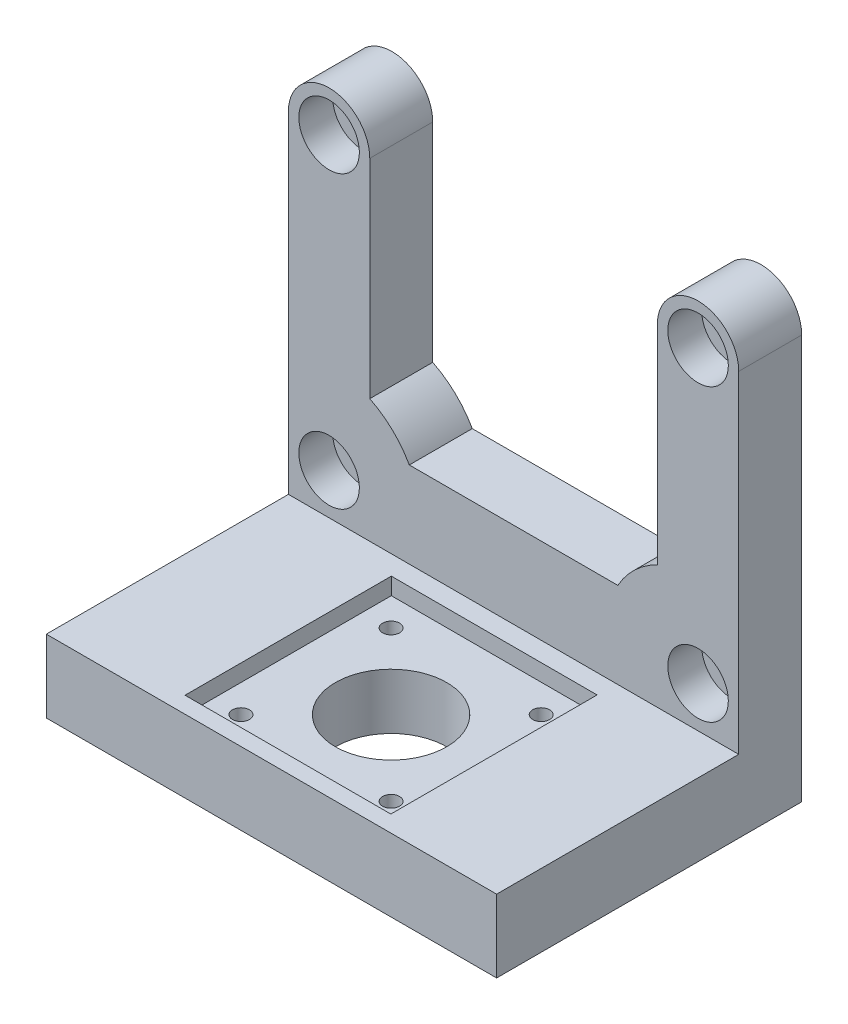
ISO-10303-21;
HEADER;
FILE_DESCRIPTION(('STEP AP214'),'2;1');
FILE_NAME('part.step','',(''),(''),'','','');
FILE_SCHEMA(('AUTOMOTIVE_DESIGN { 1 0 10303 214 1 1 1 1 }'));
ENDSEC;
DATA;
#1=APPLICATION_CONTEXT('core data for automotive mechanical design processes');
#2=APPLICATION_PROTOCOL_DEFINITION('international standard','automotive_design',2000,#1);
#3=PRODUCT_CONTEXT('',#1,'mechanical');
#4=PRODUCT('Part','Part','',(#3));
#5=PRODUCT_RELATED_PRODUCT_CATEGORY('part','',(#4));
#6=PRODUCT_DEFINITION_FORMATION('','',#4);
#7=PRODUCT_DEFINITION_CONTEXT('part definition',#1,'design');
#8=PRODUCT_DEFINITION('design','',#6,#7);
#9=PRODUCT_DEFINITION_SHAPE('','',#8);
#10=(LENGTH_UNIT() NAMED_UNIT(*) SI_UNIT(.MILLI.,.METRE.));
#11=(NAMED_UNIT(*) PLANE_ANGLE_UNIT() SI_UNIT($,.RADIAN.));
#12=(NAMED_UNIT(*) SI_UNIT($,.STERADIAN.) SOLID_ANGLE_UNIT());
#13=UNCERTAINTY_MEASURE_WITH_UNIT(LENGTH_MEASURE(1.E-05),#10,'distance_accuracy_value','');
#14=(GEOMETRIC_REPRESENTATION_CONTEXT(3) GLOBAL_UNCERTAINTY_ASSIGNED_CONTEXT((#13)) GLOBAL_UNIT_ASSIGNED_CONTEXT((#10,
#11,#12)) REPRESENTATION_CONTEXT('',''));
#15=CARTESIAN_POINT('',(0.,0.,0.));
#16=DIRECTION('',(0.,0.,1.));
#17=DIRECTION('',(1.,0.,0.));
#18=AXIS2_PLACEMENT_3D('',#15,#16,#17);
#19=CARTESIAN_POINT('',(-93.,86.9650108875533,0.));
#20=DIRECTION('',(0.,0.,1.));
#21=DIRECTION('',(1.,0.,0.));
#22=AXIS2_PLACEMENT_3D('',#19,#20,#21);
#23=PLANE('',#22);
#24=CARTESIAN_POINT('',(-8.4,8.5,0.));
#25=DIRECTION('',(0.,0.,1.));
#26=DIRECTION('',(1.,0.,0.));
#27=AXIS2_PLACEMENT_3D('',#24,#25,#26);
#28=CIRCLE('',#27,6.25);
#29=CARTESIAN_POINT('',(-2.15,8.5,0.));
#30=VERTEX_POINT('',#29);
#31=EDGE_CURVE('E392',#30,#30,#28,.F.);
#32=ORIENTED_EDGE('',*,*,#31,.T.);
#33=EDGE_LOOP('',(#32));
#34=FACE_BOUND('',#33,.T.);
#35=CARTESIAN_POINT('',(-84.6,8.5,0.));
#36=DIRECTION('',(0.,0.,1.));
#37=DIRECTION('',(1.,0.,0.));
#38=AXIS2_PLACEMENT_3D('',#35,#36,#37);
#39=CIRCLE('',#38,6.25);
#40=CARTESIAN_POINT('',(-78.35,8.5,0.));
#41=VERTEX_POINT('',#40);
#42=EDGE_CURVE('E258',#41,#41,#39,.F.);
#43=ORIENTED_EDGE('',*,*,#42,.T.);
#44=EDGE_LOOP('',(#43));
#45=FACE_BOUND('',#44,.T.);
#46=CARTESIAN_POINT('',(-8.4,68.5,0.));
#47=DIRECTION('',(0.,0.,1.));
#48=DIRECTION('',(1.,0.,0.));
#49=AXIS2_PLACEMENT_3D('',#46,#47,#48);
#50=CIRCLE('',#49,6.25000000000001);
#51=CARTESIAN_POINT('',(-2.14999999999999,68.5,0.));
#52=VERTEX_POINT('',#51);
#53=EDGE_CURVE('E390',#52,#52,#50,.F.);
#54=ORIENTED_EDGE('',*,*,#53,.T.);
#55=EDGE_LOOP('',(#54));
#56=FACE_BOUND('',#55,.T.);
#57=CARTESIAN_POINT('',(-84.6,68.5,0.));
#58=DIRECTION('',(0.,0.,1.));
#59=DIRECTION('',(1.,0.,0.));
#60=AXIS2_PLACEMENT_3D('',#57,#58,#59);
#61=CIRCLE('',#60,6.25);
#62=CARTESIAN_POINT('',(-78.35,68.5,0.));
#63=VERTEX_POINT('',#62);
#64=EDGE_CURVE('E59',#63,#63,#61,.F.);
#65=ORIENTED_EDGE('',*,*,#64,.T.);
#66=EDGE_LOOP('',(#65));
#67=FACE_BOUND('',#66,.T.);
#68=DIRECTION('',(0.,-1.,0.));
#69=VECTOR('',#68,1.);
#70=CARTESIAN_POINT('',(-76.2,0.,0.));
#71=LINE('',#70,#69);
#72=CARTESIAN_POINT('',(-76.2,68.5,0.));
#73=VERTEX_POINT('',#72);
#74=CARTESIAN_POINT('',(-76.2,25.5085891767193,0.));
#75=VERTEX_POINT('',#74);
#76=EDGE_CURVE('E195',#73,#75,#71,.T.);
#77=ORIENTED_EDGE('',*,*,#76,.F.);
#78=CARTESIAN_POINT('',(-84.6,68.5,0.));
#79=DIRECTION('',(0.,0.,1.));
#80=DIRECTION('',(1.,0.,0.));
#81=AXIS2_PLACEMENT_3D('',#78,#79,#80);
#82=CIRCLE('',#81,8.39999999999999);
#83=CARTESIAN_POINT('',(-93.,68.5,0.));
#84=VERTEX_POINT('',#83);
#85=EDGE_CURVE('E198',#73,#84,#82,.T.);
#86=ORIENTED_EDGE('',*,*,#85,.T.);
#87=DIRECTION('',(0.,-1.,0.));
#88=VECTOR('',#87,1.);
#89=CARTESIAN_POINT('',(-93.,86.9650108875533,0.));
#90=LINE('',#89,#88);
#91=CARTESIAN_POINT('',(-93.,0.,0.));
#92=VERTEX_POINT('',#91);
#93=EDGE_CURVE('E356',#84,#92,#90,.T.);
#94=ORIENTED_EDGE('',*,*,#93,.T.);
#95=DIRECTION('',(1.,0.,0.));
#96=VECTOR('',#95,1.);
#97=CARTESIAN_POINT('',(-93.,0.,0.));
#98=LINE('',#97,#96);
#99=CARTESIAN_POINT('',(0.,0.,0.));
#100=VERTEX_POINT('',#99);
#101=EDGE_CURVE('E370',#92,#100,#98,.T.);
#102=ORIENTED_EDGE('',*,*,#101,.T.);
#103=DIRECTION('',(0.,-1.,0.));
#104=VECTOR('',#103,1.);
#105=CARTESIAN_POINT('',(0.,86.9650108875533,0.));
#106=LINE('',#105,#104);
#107=CARTESIAN_POINT('',(0.,68.5,0.));
#108=VERTEX_POINT('',#107);
#109=EDGE_CURVE('E350',#108,#100,#106,.T.);
#110=ORIENTED_EDGE('',*,*,#109,.F.);
#111=CARTESIAN_POINT('',(-8.4,68.5,0.));
#112=DIRECTION('',(0.,0.,1.));
#113=DIRECTION('',(1.,0.,0.));
#114=AXIS2_PLACEMENT_3D('',#111,#112,#113);
#115=CIRCLE('',#114,8.39999999999999);
#116=CARTESIAN_POINT('',(-16.8,68.5,0.));
#117=VERTEX_POINT('',#116);
#118=EDGE_CURVE('E72',#108,#117,#115,.T.);
#119=ORIENTED_EDGE('',*,*,#118,.T.);
#120=DIRECTION('',(0.,-1.,0.));
#121=VECTOR('',#120,1.);
#122=CARTESIAN_POINT('',(-16.8,0.,0.));
#123=LINE('',#122,#121);
#124=CARTESIAN_POINT('',(-16.8,25.5085891767193,0.));
#125=VERTEX_POINT('',#124);
#126=EDGE_CURVE('E215',#117,#125,#123,.T.);
#127=ORIENTED_EDGE('',*,*,#126,.T.);
#128=CARTESIAN_POINT('',(-8.4,8.5,0.));
#129=DIRECTION('',(0.,0.,1.));
#130=DIRECTION('',(1.,0.,0.));
#131=AXIS2_PLACEMENT_3D('',#128,#129,#130);
#132=CIRCLE('',#131,18.9697682058166);
#133=CARTESIAN_POINT('',(-24.9665521480889,17.7412908030785,0.));
#134=VERTEX_POINT('',#133);
#135=EDGE_CURVE('E212',#125,#134,#132,.T.);
#136=ORIENTED_EDGE('',*,*,#135,.T.);
#137=DIRECTION('',(1.,0.,0.));
#138=VECTOR('',#137,1.);
#139=CARTESIAN_POINT('',(0.,17.7412908030785,0.));
#140=LINE('',#139,#138);
#141=CARTESIAN_POINT('',(-68.0334478519111,17.7412908030785,0.));
#142=VERTEX_POINT('',#141);
#143=EDGE_CURVE('E210',#142,#134,#140,.T.);
#144=ORIENTED_EDGE('',*,*,#143,.F.);
#145=CARTESIAN_POINT('',(-84.6,8.5,0.));
#146=DIRECTION('',(0.,0.,1.));
#147=DIRECTION('',(1.,0.,0.));
#148=AXIS2_PLACEMENT_3D('',#145,#146,#147);
#149=CIRCLE('',#148,18.9697682058166);
#150=EDGE_CURVE('E175',#142,#75,#149,.T.);
#151=ORIENTED_EDGE('',*,*,#150,.T.);
#152=EDGE_LOOP('',(#77,#86,#94,#102,#110,#119,#127,#136,#144,#151));
#153=FACE_BOUND('',#152,.T.);
#154=ADVANCED_FACE('F56',(#34,#45,#56,#67,#153),#23,.T.);
#155=CARTESIAN_POINT('',(-93.,-15.,-13.));
#156=DIRECTION('',(0.,0.,-1.));
#157=DIRECTION('',(0.,1.,0.));
#158=AXIS2_PLACEMENT_3D('',#155,#156,#157);
#159=PLANE('',#158);
#160=CARTESIAN_POINT('',(-84.6,8.5,-13.));
#161=DIRECTION('',(0.,0.,1.));
#162=DIRECTION('',(1.,0.,0.));
#163=AXIS2_PLACEMENT_3D('',#160,#161,#162);
#164=CIRCLE('',#163,3.25000000000001);
#165=CARTESIAN_POINT('',(-81.35,8.5,-13.));
#166=VERTEX_POINT('',#165);
#167=EDGE_CURVE('E266',#166,#166,#164,.T.);
#168=ORIENTED_EDGE('',*,*,#167,.T.);
#169=EDGE_LOOP('',(#168));
#170=FACE_BOUND('',#169,.T.);
#171=CARTESIAN_POINT('',(-8.4,8.5,-13.));
#172=DIRECTION('',(0.,0.,1.));
#173=DIRECTION('',(1.,0.,0.));
#174=AXIS2_PLACEMENT_3D('',#171,#172,#173);
#175=CIRCLE('',#174,3.25);
#176=CARTESIAN_POINT('',(-5.15,8.5,-13.));
#177=VERTEX_POINT('',#176);
#178=EDGE_CURVE('E263',#177,#177,#175,.T.);
#179=ORIENTED_EDGE('',*,*,#178,.T.);
#180=EDGE_LOOP('',(#179));
#181=FACE_BOUND('',#180,.T.);
#182=CARTESIAN_POINT('',(-8.4,68.5,-13.));
#183=DIRECTION('',(0.,0.,1.));
#184=DIRECTION('',(1.,0.,0.));
#185=AXIS2_PLACEMENT_3D('',#182,#183,#184);
#186=CIRCLE('',#185,3.25);
#187=CARTESIAN_POINT('',(-5.15,68.5,-13.));
#188=VERTEX_POINT('',#187);
#189=EDGE_CURVE('E259',#188,#188,#186,.T.);
#190=ORIENTED_EDGE('',*,*,#189,.T.);
#191=EDGE_LOOP('',(#190));
#192=FACE_BOUND('',#191,.T.);
#193=CARTESIAN_POINT('',(-84.6,68.5,-13.));
#194=DIRECTION('',(0.,0.,1.));
#195=DIRECTION('',(1.,0.,0.));
#196=AXIS2_PLACEMENT_3D('',#193,#194,#195);
#197=CIRCLE('',#196,3.25000000000001);
#198=CARTESIAN_POINT('',(-81.35,68.5,-13.));
#199=VERTEX_POINT('',#198);
#200=EDGE_CURVE('E262',#199,#199,#197,.T.);
#201=ORIENTED_EDGE('',*,*,#200,.T.);
#202=EDGE_LOOP('',(#201));
#203=FACE_BOUND('',#202,.T.);
#204=DIRECTION('',(0.,1.,0.));
#205=VECTOR('',#204,1.);
#206=CARTESIAN_POINT('',(-93.,-15.,-13.));
#207=LINE('',#206,#205);
#208=CARTESIAN_POINT('',(-93.,-15.,-13.));
#209=VERTEX_POINT('',#208);
#210=CARTESIAN_POINT('',(-93.,68.5,-13.));
#211=VERTEX_POINT('',#210);
#212=EDGE_CURVE('E368',#209,#211,#207,.T.);
#213=ORIENTED_EDGE('',*,*,#212,.T.);
#214=CARTESIAN_POINT('',(-84.6,68.5,-13.));
#215=DIRECTION('',(0.,0.,1.));
#216=DIRECTION('',(1.,0.,0.));
#217=AXIS2_PLACEMENT_3D('',#214,#215,#216);
#218=CIRCLE('',#217,8.39999999999999);
#219=CARTESIAN_POINT('',(-76.2,68.5,-13.));
#220=VERTEX_POINT('',#219);
#221=EDGE_CURVE('E206',#220,#211,#218,.T.);
#222=ORIENTED_EDGE('',*,*,#221,.F.);
#223=DIRECTION('',(0.,-1.,0.));
#224=VECTOR('',#223,1.);
#225=CARTESIAN_POINT('',(-76.2,0.,-13.));
#226=LINE('',#225,#224);
#227=CARTESIAN_POINT('',(-76.2,25.5085891767193,-13.));
#228=VERTEX_POINT('',#227);
#229=EDGE_CURVE('E180',#220,#228,#226,.T.);
#230=ORIENTED_EDGE('',*,*,#229,.T.);
#231=CARTESIAN_POINT('',(-84.6,8.5,-13.));
#232=DIRECTION('',(0.,0.,1.));
#233=DIRECTION('',(1.,0.,0.));
#234=AXIS2_PLACEMENT_3D('',#231,#232,#233);
#235=CIRCLE('',#234,18.9697682058166);
#236=CARTESIAN_POINT('',(-68.0334478519111,17.7412908030785,-13.));
#237=VERTEX_POINT('',#236);
#238=EDGE_CURVE('E172',#237,#228,#235,.T.);
#239=ORIENTED_EDGE('',*,*,#238,.F.);
#240=DIRECTION('',(1.,0.,0.));
#241=VECTOR('',#240,1.);
#242=CARTESIAN_POINT('',(0.,17.7412908030785,-13.));
#243=LINE('',#242,#241);
#244=CARTESIAN_POINT('',(-24.9665521480889,17.7412908030785,-13.));
#245=VERTEX_POINT('',#244);
#246=EDGE_CURVE('E184',#237,#245,#243,.T.);
#247=ORIENTED_EDGE('',*,*,#246,.T.);
#248=CARTESIAN_POINT('',(-8.4,8.5,-13.));
#249=DIRECTION('',(0.,0.,1.));
#250=DIRECTION('',(1.,0.,0.));
#251=AXIS2_PLACEMENT_3D('',#248,#249,#250);
#252=CIRCLE('',#251,18.9697682058166);
#253=CARTESIAN_POINT('',(-16.8,25.5085891767193,-13.));
#254=VERTEX_POINT('',#253);
#255=EDGE_CURVE('E188',#254,#245,#252,.T.);
#256=ORIENTED_EDGE('',*,*,#255,.F.);
#257=DIRECTION('',(0.,-1.,0.));
#258=VECTOR('',#257,1.);
#259=CARTESIAN_POINT('',(-16.8,0.,-13.));
#260=LINE('',#259,#258);
#261=CARTESIAN_POINT('',(-16.8,68.5,-13.));
#262=VERTEX_POINT('',#261);
#263=EDGE_CURVE('E202',#262,#254,#260,.T.);
#264=ORIENTED_EDGE('',*,*,#263,.F.);
#265=CARTESIAN_POINT('',(-8.4,68.5,-13.));
#266=DIRECTION('',(0.,0.,1.));
#267=DIRECTION('',(1.,0.,0.));
#268=AXIS2_PLACEMENT_3D('',#265,#266,#267);
#269=CIRCLE('',#268,8.39999999999999);
#270=CARTESIAN_POINT('',(0.,68.5,-13.));
#271=VERTEX_POINT('',#270);
#272=EDGE_CURVE('E204',#271,#262,#269,.T.);
#273=ORIENTED_EDGE('',*,*,#272,.F.);
#274=DIRECTION('',(0.,1.,0.));
#275=VECTOR('',#274,1.);
#276=CARTESIAN_POINT('',(0.,-15.,-13.));
#277=LINE('',#276,#275);
#278=CARTESIAN_POINT('',(0.,-15.,-13.));
#279=VERTEX_POINT('',#278);
#280=EDGE_CURVE('E359',#279,#271,#277,.T.);
#281=ORIENTED_EDGE('',*,*,#280,.F.);
#282=DIRECTION('',(1.,0.,0.));
#283=VECTOR('',#282,1.);
#284=CARTESIAN_POINT('',(-93.,-15.,-13.));
#285=LINE('',#284,#283);
#286=EDGE_CURVE('E12',#209,#279,#285,.T.);
#287=ORIENTED_EDGE('',*,*,#286,.F.);
#288=EDGE_LOOP('',(#213,#222,#230,#239,#247,#256,#264,#273,#281,#287));
#289=FACE_BOUND('',#288,.T.);
#290=ADVANCED_FACE('F192',(#170,#181,#192,#203,#289),#159,.T.);
#291=CARTESIAN_POINT('',(-84.6,68.5,-13.));
#292=DIRECTION('',(0.,0.,1.));
#293=DIRECTION('',(1.,0.,0.));
#294=AXIS2_PLACEMENT_3D('',#291,#292,#293);
#295=CYLINDRICAL_SURFACE('',#294,3.25000000000001);
#296=ORIENTED_EDGE('',*,*,#200,.F.);
#297=EDGE_LOOP('',(#296));
#298=FACE_BOUND('',#297,.T.);
#299=CARTESIAN_POINT('',(-84.6,68.5,-7.));
#300=DIRECTION('',(0.,0.,1.));
#301=DIRECTION('',(1.,0.,0.));
#302=AXIS2_PLACEMENT_3D('',#299,#300,#301);
#303=CIRCLE('',#302,3.25000000000001);
#304=CARTESIAN_POINT('',(-81.35,68.5,-7.));
#305=VERTEX_POINT('',#304);
#306=EDGE_CURVE('E223',#305,#305,#303,.T.);
#307=ORIENTED_EDGE('',*,*,#306,.T.);
#308=EDGE_LOOP('',(#307));
#309=FACE_BOUND('',#308,.T.);
#310=ADVANCED_FACE('F423',(#298,#309),#295,.F.);
#311=CARTESIAN_POINT('',(-8.4,68.5,-13.));
#312=DIRECTION('',(0.,0.,1.));
#313=DIRECTION('',(1.,0.,0.));
#314=AXIS2_PLACEMENT_3D('',#311,#312,#313);
#315=CYLINDRICAL_SURFACE('',#314,3.25);
#316=ORIENTED_EDGE('',*,*,#189,.F.);
#317=EDGE_LOOP('',(#316));
#318=FACE_BOUND('',#317,.T.);
#319=CARTESIAN_POINT('',(-8.4,68.5,-7.));
#320=DIRECTION('',(0.,0.,1.));
#321=DIRECTION('',(1.,0.,0.));
#322=AXIS2_PLACEMENT_3D('',#319,#320,#321);
#323=CIRCLE('',#322,3.25);
#324=CARTESIAN_POINT('',(-5.15,68.5,-7.));
#325=VERTEX_POINT('',#324);
#326=EDGE_CURVE('E235',#325,#325,#323,.T.);
#327=ORIENTED_EDGE('',*,*,#326,.T.);
#328=EDGE_LOOP('',(#327));
#329=FACE_BOUND('',#328,.T.);
#330=ADVANCED_FACE('F470',(#318,#329),#315,.F.);
#331=CARTESIAN_POINT('',(-8.4,8.5,-13.));
#332=DIRECTION('',(0.,0.,1.));
#333=DIRECTION('',(1.,0.,0.));
#334=AXIS2_PLACEMENT_3D('',#331,#332,#333);
#335=CYLINDRICAL_SURFACE('',#334,3.25);
#336=ORIENTED_EDGE('',*,*,#178,.F.);
#337=EDGE_LOOP('',(#336));
#338=FACE_BOUND('',#337,.T.);
#339=CARTESIAN_POINT('',(-8.4,8.5,-7.));
#340=DIRECTION('',(0.,0.,1.));
#341=DIRECTION('',(1.,0.,0.));
#342=AXIS2_PLACEMENT_3D('',#339,#340,#341);
#343=CIRCLE('',#342,3.25);
#344=CARTESIAN_POINT('',(-5.15,8.5,-7.));
#345=VERTEX_POINT('',#344);
#346=EDGE_CURVE('E243',#345,#345,#343,.T.);
#347=ORIENTED_EDGE('',*,*,#346,.T.);
#348=EDGE_LOOP('',(#347));
#349=FACE_BOUND('',#348,.T.);
#350=ADVANCED_FACE('F473',(#338,#349),#335,.F.);
#351=CARTESIAN_POINT('',(-84.6,8.5,-13.));
#352=DIRECTION('',(0.,0.,1.));
#353=DIRECTION('',(1.,0.,0.));
#354=AXIS2_PLACEMENT_3D('',#351,#352,#353);
#355=CYLINDRICAL_SURFACE('',#354,3.25000000000001);
#356=ORIENTED_EDGE('',*,*,#167,.F.);
#357=EDGE_LOOP('',(#356));
#358=FACE_BOUND('',#357,.T.);
#359=CARTESIAN_POINT('',(-84.6,8.5,-7.));
#360=DIRECTION('',(0.,0.,1.));
#361=DIRECTION('',(1.,0.,0.));
#362=AXIS2_PLACEMENT_3D('',#359,#360,#361);
#363=CIRCLE('',#362,3.25000000000001);
#364=CARTESIAN_POINT('',(-81.35,8.5,-7.));
#365=VERTEX_POINT('',#364);
#366=EDGE_CURVE('E242',#365,#365,#363,.T.);
#367=ORIENTED_EDGE('',*,*,#366,.T.);
#368=EDGE_LOOP('',(#367));
#369=FACE_BOUND('',#368,.T.);
#370=ADVANCED_FACE('F477',(#358,#369),#355,.F.);
#371=CARTESIAN_POINT('',(-62.,-15.,9.8));
#372=DIRECTION('',(0.,1.,0.));
#373=DIRECTION('',(0.,0.,1.));
#374=AXIS2_PLACEMENT_3D('',#371,#372,#373);
#375=CYLINDRICAL_SURFACE('',#374,1.75);
#376=CARTESIAN_POINT('',(-62.,-3.5,9.8));
#377=DIRECTION('',(0.,1.,0.));
#378=DIRECTION('',(0.,0.,1.));
#379=AXIS2_PLACEMENT_3D('',#376,#377,#378);
#380=CIRCLE('',#379,1.75);
#381=CARTESIAN_POINT('',(-62.,-3.5,11.55));
#382=VERTEX_POINT('',#381);
#383=EDGE_CURVE('E311',#382,#382,#380,.T.);
#384=ORIENTED_EDGE('',*,*,#383,.T.);
#385=EDGE_LOOP('',(#384));
#386=FACE_BOUND('',#385,.T.);
#387=CARTESIAN_POINT('',(-62.,-12.,9.8));
#388=DIRECTION('',(0.,-1.,0.));
#389=DIRECTION('',(0.,0.,-1.));
#390=AXIS2_PLACEMENT_3D('',#387,#388,#389);
#391=CIRCLE('',#390,1.75);
#392=CARTESIAN_POINT('',(-62.,-12.,8.05));
#393=VERTEX_POINT('',#392);
#394=EDGE_CURVE('E280',#393,#393,#391,.T.);
#395=ORIENTED_EDGE('',*,*,#394,.T.);
#396=EDGE_LOOP('',(#395));
#397=FACE_BOUND('',#396,.T.);
#398=ADVANCED_FACE('F481',(#386,#397),#375,.F.);
#399=CARTESIAN_POINT('',(-31.,-15.,9.8));
#400=DIRECTION('',(0.,1.,0.));
#401=DIRECTION('',(0.,0.,1.));
#402=AXIS2_PLACEMENT_3D('',#399,#400,#401);
#403=CYLINDRICAL_SURFACE('',#402,1.75);
#404=CARTESIAN_POINT('',(-31.,-3.5,9.8));
#405=DIRECTION('',(0.,1.,0.));
#406=DIRECTION('',(0.,0.,1.));
#407=AXIS2_PLACEMENT_3D('',#404,#405,#406);
#408=CIRCLE('',#407,1.75);
#409=CARTESIAN_POINT('',(-31.,-3.5,11.55));
#410=VERTEX_POINT('',#409);
#411=EDGE_CURVE('E308',#410,#410,#408,.T.);
#412=ORIENTED_EDGE('',*,*,#411,.T.);
#413=EDGE_LOOP('',(#412));
#414=FACE_BOUND('',#413,.T.);
#415=CARTESIAN_POINT('',(-31.,-12.,9.8));
#416=DIRECTION('',(0.,-1.,0.));
#417=DIRECTION('',(0.,0.,-1.));
#418=AXIS2_PLACEMENT_3D('',#415,#416,#417);
#419=CIRCLE('',#418,1.75);
#420=CARTESIAN_POINT('',(-31.,-12.,8.05));
#421=VERTEX_POINT('',#420);
#422=EDGE_CURVE('E272',#421,#421,#419,.T.);
#423=ORIENTED_EDGE('',*,*,#422,.T.);
#424=EDGE_LOOP('',(#423));
#425=FACE_BOUND('',#424,.T.);
#426=ADVANCED_FACE('F518',(#414,#425),#403,.F.);
#427=CARTESIAN_POINT('',(-31.,-15.,40.8));
#428=DIRECTION('',(0.,1.,0.));
#429=DIRECTION('',(0.,0.,1.));
#430=AXIS2_PLACEMENT_3D('',#427,#428,#429);
#431=CYLINDRICAL_SURFACE('',#430,1.75);
#432=CARTESIAN_POINT('',(-31.,-3.5,40.8));
#433=DIRECTION('',(0.,1.,0.));
#434=DIRECTION('',(0.,0.,1.));
#435=AXIS2_PLACEMENT_3D('',#432,#433,#434);
#436=CIRCLE('',#435,1.75);
#437=CARTESIAN_POINT('',(-31.,-3.5,42.55));
#438=VERTEX_POINT('',#437);
#439=EDGE_CURVE('E312',#438,#438,#436,.T.);
#440=ORIENTED_EDGE('',*,*,#439,.T.);
#441=EDGE_LOOP('',(#440));
#442=FACE_BOUND('',#441,.T.);
#443=CARTESIAN_POINT('',(-31.,-12.,40.8));
#444=DIRECTION('',(0.,-1.,0.));
#445=DIRECTION('',(0.,0.,-1.));
#446=AXIS2_PLACEMENT_3D('',#443,#444,#445);
#447=CIRCLE('',#446,1.75);
#448=CARTESIAN_POINT('',(-31.,-12.,39.05));
#449=VERTEX_POINT('',#448);
#450=EDGE_CURVE('E283',#449,#449,#447,.T.);
#451=ORIENTED_EDGE('',*,*,#450,.T.);
#452=EDGE_LOOP('',(#451));
#453=FACE_BOUND('',#452,.T.);
#454=ADVANCED_FACE('F521',(#442,#453),#431,.F.);
#455=CARTESIAN_POINT('',(-62.,-15.,40.8));
#456=DIRECTION('',(0.,1.,0.));
#457=DIRECTION('',(0.,0.,1.));
#458=AXIS2_PLACEMENT_3D('',#455,#456,#457);
#459=CYLINDRICAL_SURFACE('',#458,1.75);
#460=CARTESIAN_POINT('',(-62.,-3.5,40.8));
#461=DIRECTION('',(0.,1.,0.));
#462=DIRECTION('',(0.,0.,1.));
#463=AXIS2_PLACEMENT_3D('',#460,#461,#462);
#464=CIRCLE('',#463,1.75);
#465=CARTESIAN_POINT('',(-62.,-3.5,42.55));
#466=VERTEX_POINT('',#465);
#467=EDGE_CURVE('E305',#466,#466,#464,.T.);
#468=ORIENTED_EDGE('',*,*,#467,.T.);
#469=EDGE_LOOP('',(#468));
#470=FACE_BOUND('',#469,.T.);
#471=CARTESIAN_POINT('',(-62.,-12.,40.8));
#472=DIRECTION('',(0.,-1.,0.));
#473=DIRECTION('',(0.,0.,-1.));
#474=AXIS2_PLACEMENT_3D('',#471,#472,#473);
#475=CIRCLE('',#474,1.75);
#476=CARTESIAN_POINT('',(-62.,-12.,39.05));
#477=VERTEX_POINT('',#476);
#478=EDGE_CURVE('E271',#477,#477,#475,.T.);
#479=ORIENTED_EDGE('',*,*,#478,.T.);
#480=EDGE_LOOP('',(#479));
#481=FACE_BOUND('',#480,.T.);
#482=ADVANCED_FACE('F525',(#470,#481),#459,.F.);
#483=CARTESIAN_POINT('',(-93.,-15.,50.));
#484=DIRECTION('',(0.,-1.,0.));
#485=DIRECTION('',(0.,0.,-1.));
#486=AXIS2_PLACEMENT_3D('',#483,#484,#485);
#487=PLANE('',#486);
#488=CARTESIAN_POINT('',(-62.,-15.,40.8));
#489=DIRECTION('',(0.,-1.,0.));
#490=DIRECTION('',(0.,0.,-1.));
#491=AXIS2_PLACEMENT_3D('',#488,#489,#490);
#492=CIRCLE('',#491,3.);
#493=CARTESIAN_POINT('',(-62.,-15.,37.8));
#494=VERTEX_POINT('',#493);
#495=EDGE_CURVE('E294',#494,#494,#492,.T.);
#496=ORIENTED_EDGE('',*,*,#495,.F.);
#497=EDGE_LOOP('',(#496));
#498=FACE_BOUND('',#497,.T.);
#499=CARTESIAN_POINT('',(-31.,-15.,40.8));
#500=DIRECTION('',(0.,-1.,0.));
#501=DIRECTION('',(0.,0.,-1.));
#502=AXIS2_PLACEMENT_3D('',#499,#500,#501);
#503=CIRCLE('',#502,3.);
#504=CARTESIAN_POINT('',(-31.,-15.,37.8));
#505=VERTEX_POINT('',#504);
#506=EDGE_CURVE('E286',#505,#505,#503,.T.);
#507=ORIENTED_EDGE('',*,*,#506,.F.);
#508=EDGE_LOOP('',(#507));
#509=FACE_BOUND('',#508,.T.);
#510=CARTESIAN_POINT('',(-31.,-15.,9.8));
#511=DIRECTION('',(0.,-1.,0.));
#512=DIRECTION('',(0.,0.,-1.));
#513=AXIS2_PLACEMENT_3D('',#510,#511,#512);
#514=CIRCLE('',#513,3.);
#515=CARTESIAN_POINT('',(-31.,-15.,6.8));
#516=VERTEX_POINT('',#515);
#517=EDGE_CURVE('E275',#516,#516,#514,.T.);
#518=ORIENTED_EDGE('',*,*,#517,.F.);
#519=EDGE_LOOP('',(#518));
#520=FACE_BOUND('',#519,.T.);
#521=CARTESIAN_POINT('',(-62.,-15.,9.8));
#522=DIRECTION('',(0.,-1.,0.));
#523=DIRECTION('',(0.,0.,-1.));
#524=AXIS2_PLACEMENT_3D('',#521,#522,#523);
#525=CIRCLE('',#524,3.);
#526=CARTESIAN_POINT('',(-62.,-15.,6.8));
#527=VERTEX_POINT('',#526);
#528=EDGE_CURVE('E301',#527,#527,#525,.T.);
#529=ORIENTED_EDGE('',*,*,#528,.F.);
#530=EDGE_LOOP('',(#529));
#531=FACE_BOUND('',#530,.T.);
#532=CARTESIAN_POINT('',(-46.5,-15.,25.3));
#533=DIRECTION('',(0.,1.,0.));
#534=DIRECTION('',(0.,0.,1.));
#535=AXIS2_PLACEMENT_3D('',#532,#533,#534);
#536=CIRCLE('',#535,11.5);
#537=CARTESIAN_POINT('',(-46.5,-15.,36.8));
#538=VERTEX_POINT('',#537);
#539=EDGE_CURVE('E320',#538,#538,#536,.T.);
#540=ORIENTED_EDGE('',*,*,#539,.T.);
#541=EDGE_LOOP('',(#540));
#542=FACE_BOUND('',#541,.T.);
#543=DIRECTION('',(0.,0.,-1.));
#544=VECTOR('',#543,1.);
#545=CARTESIAN_POINT('',(0.,-15.,50.));
#546=LINE('',#545,#544);
#547=CARTESIAN_POINT('',(0.,-15.,50.));
#548=VERTEX_POINT('',#547);
#549=EDGE_CURVE('E378',#548,#279,#546,.T.);
#550=ORIENTED_EDGE('',*,*,#549,.F.);
#551=DIRECTION('',(1.,0.,0.));
#552=VECTOR('',#551,1.);
#553=CARTESIAN_POINT('',(-93.,-15.,50.));
#554=LINE('',#553,#552);
#555=CARTESIAN_POINT('',(-93.,-15.,50.));
#556=VERTEX_POINT('',#555);
#557=EDGE_CURVE('E64',#556,#548,#554,.T.);
#558=ORIENTED_EDGE('',*,*,#557,.F.);
#559=DIRECTION('',(0.,0.,-1.));
#560=VECTOR('',#559,1.);
#561=CARTESIAN_POINT('',(-93.,-15.,50.));
#562=LINE('',#561,#560);
#563=EDGE_CURVE('E365',#556,#209,#562,.T.);
#564=ORIENTED_EDGE('',*,*,#563,.T.);
#565=ORIENTED_EDGE('',*,*,#286,.T.);
#566=EDGE_LOOP('',(#550,#558,#564,#565));
#567=FACE_BOUND('',#566,.T.);
#568=ADVANCED_FACE('F529',(#498,#509,#520,#531,#542,#567),#487,.T.);
#569=CARTESIAN_POINT('',(-93.,0.,50.));
#570=DIRECTION('',(0.,0.,1.));
#571=DIRECTION('',(1.,0.,0.));
#572=AXIS2_PLACEMENT_3D('',#569,#570,#571);
#573=PLANE('',#572);
#574=DIRECTION('',(0.,-1.,0.));
#575=VECTOR('',#574,1.);
#576=CARTESIAN_POINT('',(0.,0.,50.));
#577=LINE('',#576,#575);
#578=CARTESIAN_POINT('',(0.,0.,50.));
#579=VERTEX_POINT('',#578);
#580=EDGE_CURVE('E375',#579,#548,#577,.T.);
#581=ORIENTED_EDGE('',*,*,#580,.F.);
#582=DIRECTION('',(1.,0.,0.));
#583=VECTOR('',#582,1.);
#584=CARTESIAN_POINT('',(-93.,0.,50.));
#585=LINE('',#584,#583);
#586=CARTESIAN_POINT('',(-93.,0.,50.));
#587=VERTEX_POINT('',#586);
#588=EDGE_CURVE('E384',#587,#579,#585,.T.);
#589=ORIENTED_EDGE('',*,*,#588,.F.);
#590=DIRECTION('',(0.,-1.,0.));
#591=VECTOR('',#590,1.);
#592=CARTESIAN_POINT('',(-93.,0.,50.));
#593=LINE('',#592,#591);
#594=EDGE_CURVE('E362',#587,#556,#593,.T.);
#595=ORIENTED_EDGE('',*,*,#594,.T.);
#596=ORIENTED_EDGE('',*,*,#557,.T.);
#597=EDGE_LOOP('',(#581,#589,#595,#596));
#598=FACE_BOUND('',#597,.T.);
#599=ADVANCED_FACE('F567',(#598),#573,.T.);
#600=CARTESIAN_POINT('',(-93.,0.,0.));
#601=DIRECTION('',(0.,1.,0.));
#602=DIRECTION('',(0.,0.,1.));
#603=AXIS2_PLACEMENT_3D('',#600,#601,#602);
#604=PLANE('',#603);
#605=DIRECTION('',(0.,0.,-1.));
#606=VECTOR('',#605,1.);
#607=CARTESIAN_POINT('',(-25.25,0.,46.6));
#608=LINE('',#607,#606);
#609=CARTESIAN_POINT('',(-25.25,0.,46.6));
#610=VERTEX_POINT('',#609);
#611=CARTESIAN_POINT('',(-25.25,0.,4.));
#612=VERTEX_POINT('',#611);
#613=EDGE_CURVE('E80',#610,#612,#608,.T.);
#614=ORIENTED_EDGE('',*,*,#613,.F.);
#615=DIRECTION('',(1.,0.,0.));
#616=VECTOR('',#615,1.);
#617=CARTESIAN_POINT('',(-67.75,0.,46.6));
#618=LINE('',#617,#616);
#619=CARTESIAN_POINT('',(-67.75,0.,46.6));
#620=VERTEX_POINT('',#619);
#621=EDGE_CURVE('E329',#620,#610,#618,.T.);
#622=ORIENTED_EDGE('',*,*,#621,.F.);
#623=DIRECTION('',(0.,0.,1.));
#624=VECTOR('',#623,1.);
#625=CARTESIAN_POINT('',(-67.75,0.,46.6));
#626=LINE('',#625,#624);
#627=CARTESIAN_POINT('',(-67.75,0.,4.));
#628=VERTEX_POINT('',#627);
#629=EDGE_CURVE('E343',#628,#620,#626,.T.);
#630=ORIENTED_EDGE('',*,*,#629,.F.);
#631=DIRECTION('',(-1.,0.,0.));
#632=VECTOR('',#631,1.);
#633=CARTESIAN_POINT('',(-67.75,0.,4.));
#634=LINE('',#633,#632);
#635=EDGE_CURVE('E340',#612,#628,#634,.T.);
#636=ORIENTED_EDGE('',*,*,#635,.F.);
#637=EDGE_LOOP('',(#614,#622,#630,#636));
#638=FACE_BOUND('',#637,.T.);
#639=DIRECTION('',(0.,0.,1.));
#640=VECTOR('',#639,1.);
#641=CARTESIAN_POINT('',(0.,0.,0.));
#642=LINE('',#641,#640);
#643=EDGE_CURVE('E372',#100,#579,#642,.T.);
#644=ORIENTED_EDGE('',*,*,#643,.F.);
#645=ORIENTED_EDGE('',*,*,#101,.F.);
#646=DIRECTION('',(0.,0.,1.));
#647=VECTOR('',#646,1.);
#648=CARTESIAN_POINT('',(-93.,0.,0.));
#649=LINE('',#648,#647);
#650=EDGE_CURVE('E358',#92,#587,#649,.T.);
#651=ORIENTED_EDGE('',*,*,#650,.T.);
#652=ORIENTED_EDGE('',*,*,#588,.T.);
#653=EDGE_LOOP('',(#644,#645,#651,#652));
#654=FACE_BOUND('',#653,.T.);
#655=ADVANCED_FACE('F560',(#638,#654),#604,.T.);
#656=CARTESIAN_POINT('',(-93.,0.,0.));
#657=DIRECTION('',(-1.,0.,0.));
#658=DIRECTION('',(0.,0.,1.));
#659=AXIS2_PLACEMENT_3D('',#656,#657,#658);
#660=PLANE('',#659);
#661=DIRECTION('',(0.,0.,1.));
#662=VECTOR('',#661,1.);
#663=CARTESIAN_POINT('',(-93.,68.5,-13.));
#664=LINE('',#663,#662);
#665=EDGE_CURVE('E226',#211,#84,#664,.T.);
#666=ORIENTED_EDGE('',*,*,#665,.F.);
#667=ORIENTED_EDGE('',*,*,#212,.F.);
#668=ORIENTED_EDGE('',*,*,#563,.F.);
#669=ORIENTED_EDGE('',*,*,#594,.F.);
#670=ORIENTED_EDGE('',*,*,#650,.F.);
#671=ORIENTED_EDGE('',*,*,#93,.F.);
#672=EDGE_LOOP('',(#666,#667,#668,#669,#670,#671));
#673=FACE_BOUND('',#672,.T.);
#674=ADVANCED_FACE('F557',(#673),#660,.T.);
#675=CARTESIAN_POINT('',(0.,0.,0.));
#676=DIRECTION('',(-1.,0.,0.));
#677=DIRECTION('',(0.,0.,1.));
#678=AXIS2_PLACEMENT_3D('',#675,#676,#677);
#679=PLANE('',#678);
#680=ORIENTED_EDGE('',*,*,#280,.T.);
#681=DIRECTION('',(0.,0.,1.));
#682=VECTOR('',#681,1.);
#683=CARTESIAN_POINT('',(0.,68.5,-13.));
#684=LINE('',#683,#682);
#685=EDGE_CURVE('E228',#271,#108,#684,.T.);
#686=ORIENTED_EDGE('',*,*,#685,.T.);
#687=ORIENTED_EDGE('',*,*,#109,.T.);
#688=ORIENTED_EDGE('',*,*,#643,.T.);
#689=ORIENTED_EDGE('',*,*,#580,.T.);
#690=ORIENTED_EDGE('',*,*,#549,.T.);
#691=EDGE_LOOP('',(#680,#686,#687,#688,#689,#690));
#692=FACE_BOUND('',#691,.T.);
#693=ADVANCED_FACE('F556',(#692),#679,.F.);
#694=CARTESIAN_POINT('',(-25.25,-3.5,46.6));
#695=DIRECTION('',(1.,0.,0.));
#696=DIRECTION('',(0.,0.,-1.));
#697=AXIS2_PLACEMENT_3D('',#694,#695,#696);
#698=PLANE('',#697);
#699=ORIENTED_EDGE('',*,*,#613,.T.);
#700=DIRECTION('',(0.,1.,0.));
#701=VECTOR('',#700,1.);
#702=CARTESIAN_POINT('',(-25.25,-3.5,4.));
#703=LINE('',#702,#701);
#704=CARTESIAN_POINT('',(-25.25,-3.5,4.));
#705=VERTEX_POINT('',#704);
#706=EDGE_CURVE('E338',#705,#612,#703,.T.);
#707=ORIENTED_EDGE('',*,*,#706,.F.);
#708=DIRECTION('',(0.,0.,-1.));
#709=VECTOR('',#708,1.);
#710=CARTESIAN_POINT('',(-25.25,-3.5,46.6));
#711=LINE('',#710,#709);
#712=CARTESIAN_POINT('',(-25.25,-3.5,46.6));
#713=VERTEX_POINT('',#712);
#714=EDGE_CURVE('E325',#713,#705,#711,.T.);
#715=ORIENTED_EDGE('',*,*,#714,.F.);
#716=DIRECTION('',(0.,1.,0.));
#717=VECTOR('',#716,1.);
#718=CARTESIAN_POINT('',(-25.25,-3.5,46.6));
#719=LINE('',#718,#717);
#720=EDGE_CURVE('E348',#713,#610,#719,.T.);
#721=ORIENTED_EDGE('',*,*,#720,.T.);
#722=EDGE_LOOP('',(#699,#707,#715,#721));
#723=FACE_BOUND('',#722,.T.);
#724=ADVANCED_FACE('F546',(#723),#698,.F.);
#725=CARTESIAN_POINT('',(-67.75,-3.5,46.6));
#726=DIRECTION('',(0.,0.,1.));
#727=DIRECTION('',(1.,0.,0.));
#728=AXIS2_PLACEMENT_3D('',#725,#726,#727);
#729=PLANE('',#728);
#730=ORIENTED_EDGE('',*,*,#621,.T.);
#731=ORIENTED_EDGE('',*,*,#720,.F.);
#732=DIRECTION('',(1.,0.,0.));
#733=VECTOR('',#732,1.);
#734=CARTESIAN_POINT('',(-67.75,-3.5,46.6));
#735=LINE('',#734,#733);
#736=CARTESIAN_POINT('',(-67.75,-3.5,46.6));
#737=VERTEX_POINT('',#736);
#738=EDGE_CURVE('E335',#737,#713,#735,.T.);
#739=ORIENTED_EDGE('',*,*,#738,.F.);
#740=DIRECTION('',(0.,1.,0.));
#741=VECTOR('',#740,1.);
#742=CARTESIAN_POINT('',(-67.75,-3.5,46.6));
#743=LINE('',#742,#741);
#744=EDGE_CURVE('E351',#737,#620,#743,.T.);
#745=ORIENTED_EDGE('',*,*,#744,.T.);
#746=EDGE_LOOP('',(#730,#731,#739,#745));
#747=FACE_BOUND('',#746,.T.);
#748=ADVANCED_FACE('F542',(#747),#729,.F.);
#749=CARTESIAN_POINT('',(-67.75,-3.5,46.6));
#750=DIRECTION('',(-1.,0.,0.));
#751=DIRECTION('',(0.,0.,1.));
#752=AXIS2_PLACEMENT_3D('',#749,#750,#751);
#753=PLANE('',#752);
#754=ORIENTED_EDGE('',*,*,#629,.T.);
#755=ORIENTED_EDGE('',*,*,#744,.F.);
#756=DIRECTION('',(0.,0.,1.));
#757=VECTOR('',#756,1.);
#758=CARTESIAN_POINT('',(-67.75,-3.5,46.6));
#759=LINE('',#758,#757);
#760=CARTESIAN_POINT('',(-67.75,-3.5,4.));
#761=VERTEX_POINT('',#760);
#762=EDGE_CURVE('E332',#761,#737,#759,.T.);
#763=ORIENTED_EDGE('',*,*,#762,.F.);
#764=DIRECTION('',(0.,1.,0.));
#765=VECTOR('',#764,1.);
#766=CARTESIAN_POINT('',(-67.75,-3.5,4.));
#767=LINE('',#766,#765);
#768=EDGE_CURVE('E353',#761,#628,#767,.T.);
#769=ORIENTED_EDGE('',*,*,#768,.T.);
#770=EDGE_LOOP('',(#754,#755,#763,#769));
#771=FACE_BOUND('',#770,.T.);
#772=ADVANCED_FACE('F545',(#771),#753,.F.);
#773=CARTESIAN_POINT('',(-67.75,-3.5,4.));
#774=DIRECTION('',(0.,0.,-1.));
#775=DIRECTION('',(-1.,0.,0.));
#776=AXIS2_PLACEMENT_3D('',#773,#774,#775);
#777=PLANE('',#776);
#778=ORIENTED_EDGE('',*,*,#635,.T.);
#779=ORIENTED_EDGE('',*,*,#768,.F.);
#780=DIRECTION('',(-1.,0.,0.));
#781=VECTOR('',#780,1.);
#782=CARTESIAN_POINT('',(-67.75,-3.5,4.));
#783=LINE('',#782,#781);
#784=EDGE_CURVE('E328',#705,#761,#783,.T.);
#785=ORIENTED_EDGE('',*,*,#784,.F.);
#786=ORIENTED_EDGE('',*,*,#706,.T.);
#787=EDGE_LOOP('',(#778,#779,#785,#786));
#788=FACE_BOUND('',#787,.T.);
#789=ADVANCED_FACE('F540',(#788),#777,.F.);
#790=CARTESIAN_POINT('',(0.,-3.5,0.));
#791=DIRECTION('',(0.,-1.,0.));
#792=DIRECTION('',(0.,0.,-1.));
#793=AXIS2_PLACEMENT_3D('',#790,#791,#792);
#794=PLANE('',#793);
#795=ORIENTED_EDGE('',*,*,#467,.F.);
#796=EDGE_LOOP('',(#795));
#797=FACE_BOUND('',#796,.T.);
#798=ORIENTED_EDGE('',*,*,#439,.F.);
#799=EDGE_LOOP('',(#798));
#800=FACE_BOUND('',#799,.T.);
#801=ORIENTED_EDGE('',*,*,#411,.F.);
#802=EDGE_LOOP('',(#801));
#803=FACE_BOUND('',#802,.T.);
#804=ORIENTED_EDGE('',*,*,#383,.F.);
#805=EDGE_LOOP('',(#804));
#806=FACE_BOUND('',#805,.T.);
#807=CARTESIAN_POINT('',(-46.5,-3.5,25.3));
#808=DIRECTION('',(0.,1.,0.));
#809=DIRECTION('',(0.,0.,1.));
#810=AXIS2_PLACEMENT_3D('',#807,#808,#809);
#811=CIRCLE('',#810,11.5);
#812=CARTESIAN_POINT('',(-46.5,-3.5,36.8));
#813=VERTEX_POINT('',#812);
#814=EDGE_CURVE('E319',#813,#813,#811,.T.);
#815=ORIENTED_EDGE('',*,*,#814,.F.);
#816=EDGE_LOOP('',(#815));
#817=FACE_BOUND('',#816,.T.);
#818=ORIENTED_EDGE('',*,*,#714,.T.);
#819=ORIENTED_EDGE('',*,*,#784,.T.);
#820=ORIENTED_EDGE('',*,*,#762,.T.);
#821=ORIENTED_EDGE('',*,*,#738,.T.);
#822=EDGE_LOOP('',(#818,#819,#820,#821));
#823=FACE_BOUND('',#822,.T.);
#824=ADVANCED_FACE('F536',(#797,#800,#803,#806,#817,#823),#794,.F.);
#825=CARTESIAN_POINT('',(-46.5,-15.,25.3));
#826=DIRECTION('',(0.,1.,0.));
#827=DIRECTION('',(0.,0.,1.));
#828=AXIS2_PLACEMENT_3D('',#825,#826,#827);
#829=CYLINDRICAL_SURFACE('',#828,11.5);
#830=ORIENTED_EDGE('',*,*,#539,.F.);
#831=EDGE_LOOP('',(#830));
#832=FACE_BOUND('',#831,.T.);
#833=ORIENTED_EDGE('',*,*,#814,.T.);
#834=EDGE_LOOP('',(#833));
#835=FACE_BOUND('',#834,.T.);
#836=ADVANCED_FACE('F510',(#832,#835),#829,.F.);
#837=CARTESIAN_POINT('',(-62.,-12.,40.8));
#838=DIRECTION('',(0.,-1.,0.));
#839=DIRECTION('',(0.,0.,-1.));
#840=AXIS2_PLACEMENT_3D('',#837,#838,#839);
#841=CYLINDRICAL_SURFACE('',#840,3.);
#842=CARTESIAN_POINT('',(-62.,-12.,40.8));
#843=DIRECTION('',(0.,-1.,0.));
#844=DIRECTION('',(0.,0.,-1.));
#845=AXIS2_PLACEMENT_3D('',#842,#843,#844);
#846=CIRCLE('',#845,3.);
#847=CARTESIAN_POINT('',(-62.,-12.,37.8));
#848=VERTEX_POINT('',#847);
#849=EDGE_CURVE('E287',#848,#848,#846,.T.);
#850=ORIENTED_EDGE('',*,*,#849,.F.);
#851=EDGE_LOOP('',(#850));
#852=FACE_BOUND('',#851,.T.);
#853=ORIENTED_EDGE('',*,*,#495,.T.);
#854=EDGE_LOOP('',(#853));
#855=FACE_BOUND('',#854,.T.);
#856=ADVANCED_FACE('F506',(#852,#855),#841,.F.);
#857=CARTESIAN_POINT('',(-62.,-12.,40.8));
#858=DIRECTION('',(0.,-1.,0.));
#859=DIRECTION('',(0.,0.,-1.));
#860=AXIS2_PLACEMENT_3D('',#857,#858,#859);
#861=PLANE('',#860);
#862=ORIENTED_EDGE('',*,*,#478,.F.);
#863=EDGE_LOOP('',(#862));
#864=FACE_BOUND('',#863,.T.);
#865=ORIENTED_EDGE('',*,*,#849,.T.);
#866=EDGE_LOOP('',(#865));
#867=FACE_BOUND('',#866,.T.);
#868=ADVANCED_FACE('F502',(#864,#867),#861,.T.);
#869=CARTESIAN_POINT('',(-31.,-12.,40.8));
#870=DIRECTION('',(0.,-1.,0.));
#871=DIRECTION('',(0.,0.,-1.));
#872=AXIS2_PLACEMENT_3D('',#869,#870,#871);
#873=CYLINDRICAL_SURFACE('',#872,3.);
#874=CARTESIAN_POINT('',(-31.,-12.,40.8));
#875=DIRECTION('',(0.,-1.,0.));
#876=DIRECTION('',(0.,0.,-1.));
#877=AXIS2_PLACEMENT_3D('',#874,#875,#876);
#878=CIRCLE('',#877,3.);
#879=CARTESIAN_POINT('',(-31.,-12.,37.8));
#880=VERTEX_POINT('',#879);
#881=EDGE_CURVE('E276',#880,#880,#878,.T.);
#882=ORIENTED_EDGE('',*,*,#881,.F.);
#883=EDGE_LOOP('',(#882));
#884=FACE_BOUND('',#883,.T.);
#885=ORIENTED_EDGE('',*,*,#506,.T.);
#886=EDGE_LOOP('',(#885));
#887=FACE_BOUND('',#886,.T.);
#888=ADVANCED_FACE('F498',(#884,#887),#873,.F.);
#889=CARTESIAN_POINT('',(-31.,-12.,40.8));
#890=DIRECTION('',(0.,-1.,0.));
#891=DIRECTION('',(0.,0.,-1.));
#892=AXIS2_PLACEMENT_3D('',#889,#890,#891);
#893=PLANE('',#892);
#894=ORIENTED_EDGE('',*,*,#450,.F.);
#895=EDGE_LOOP('',(#894));
#896=FACE_BOUND('',#895,.T.);
#897=ORIENTED_EDGE('',*,*,#881,.T.);
#898=EDGE_LOOP('',(#897));
#899=FACE_BOUND('',#898,.T.);
#900=ADVANCED_FACE('F494',(#896,#899),#893,.T.);
#901=CARTESIAN_POINT('',(-31.,-12.,9.8));
#902=DIRECTION('',(0.,-1.,0.));
#903=DIRECTION('',(0.,0.,-1.));
#904=AXIS2_PLACEMENT_3D('',#901,#902,#903);
#905=CYLINDRICAL_SURFACE('',#904,3.);
#906=CARTESIAN_POINT('',(-31.,-12.,9.8));
#907=DIRECTION('',(0.,-1.,0.));
#908=DIRECTION('',(0.,0.,-1.));
#909=AXIS2_PLACEMENT_3D('',#906,#907,#908);
#910=CIRCLE('',#909,3.);
#911=CARTESIAN_POINT('',(-31.,-12.,6.8));
#912=VERTEX_POINT('',#911);
#913=EDGE_CURVE('E277',#912,#912,#910,.T.);
#914=ORIENTED_EDGE('',*,*,#913,.F.);
#915=EDGE_LOOP('',(#914));
#916=FACE_BOUND('',#915,.T.);
#917=ORIENTED_EDGE('',*,*,#517,.T.);
#918=EDGE_LOOP('',(#917));
#919=FACE_BOUND('',#918,.T.);
#920=ADVANCED_FACE('F490',(#916,#919),#905,.F.);
#921=CARTESIAN_POINT('',(-31.,-12.,9.8));
#922=DIRECTION('',(0.,-1.,0.));
#923=DIRECTION('',(0.,0.,-1.));
#924=AXIS2_PLACEMENT_3D('',#921,#922,#923);
#925=PLANE('',#924);
#926=ORIENTED_EDGE('',*,*,#422,.F.);
#927=EDGE_LOOP('',(#926));
#928=FACE_BOUND('',#927,.T.);
#929=ORIENTED_EDGE('',*,*,#913,.T.);
#930=EDGE_LOOP('',(#929));
#931=FACE_BOUND('',#930,.T.);
#932=ADVANCED_FACE('F486',(#928,#931),#925,.T.);
#933=CARTESIAN_POINT('',(-62.,-12.,9.8));
#934=DIRECTION('',(0.,-1.,0.));
#935=DIRECTION('',(0.,0.,-1.));
#936=AXIS2_PLACEMENT_3D('',#933,#934,#935);
#937=CYLINDRICAL_SURFACE('',#936,3.);
#938=CARTESIAN_POINT('',(-62.,-12.,9.8));
#939=DIRECTION('',(0.,-1.,0.));
#940=DIRECTION('',(0.,0.,-1.));
#941=AXIS2_PLACEMENT_3D('',#938,#939,#940);
#942=CIRCLE('',#941,3.);
#943=CARTESIAN_POINT('',(-62.,-12.,6.8));
#944=VERTEX_POINT('',#943);
#945=EDGE_CURVE('E302',#944,#944,#942,.T.);
#946=ORIENTED_EDGE('',*,*,#945,.F.);
#947=EDGE_LOOP('',(#946));
#948=FACE_BOUND('',#947,.T.);
#949=ORIENTED_EDGE('',*,*,#528,.T.);
#950=EDGE_LOOP('',(#949));
#951=FACE_BOUND('',#950,.T.);
#952=ADVANCED_FACE('F489',(#948,#951),#937,.F.);
#953=CARTESIAN_POINT('',(-62.,-12.,9.8));
#954=DIRECTION('',(0.,-1.,0.));
#955=DIRECTION('',(0.,0.,-1.));
#956=AXIS2_PLACEMENT_3D('',#953,#954,#955);
#957=PLANE('',#956);
#958=ORIENTED_EDGE('',*,*,#394,.F.);
#959=EDGE_LOOP('',(#958));
#960=FACE_BOUND('',#959,.T.);
#961=ORIENTED_EDGE('',*,*,#945,.T.);
#962=EDGE_LOOP('',(#961));
#963=FACE_BOUND('',#962,.T.);
#964=ADVANCED_FACE('F464',(#960,#963),#957,.T.);
#965=CARTESIAN_POINT('',(-84.6,8.5,50.));
#966=DIRECTION('',(0.,0.,-1.));
#967=DIRECTION('',(-1.,0.,0.));
#968=AXIS2_PLACEMENT_3D('',#965,#966,#967);
#969=CYLINDRICAL_SURFACE('',#968,6.25);
#970=ORIENTED_EDGE('',*,*,#42,.F.);
#971=EDGE_LOOP('',(#970));
#972=FACE_BOUND('',#971,.T.);
#973=CARTESIAN_POINT('',(-84.6,8.5,-7.));
#974=DIRECTION('',(0.,0.,1.));
#975=DIRECTION('',(1.,0.,0.));
#976=AXIS2_PLACEMENT_3D('',#973,#974,#975);
#977=CIRCLE('',#976,6.25);
#978=CARTESIAN_POINT('',(-78.35,8.5,-7.));
#979=VERTEX_POINT('',#978);
#980=EDGE_CURVE('E255',#979,#979,#977,.T.);
#981=ORIENTED_EDGE('',*,*,#980,.F.);
#982=EDGE_LOOP('',(#981));
#983=FACE_BOUND('',#982,.T.);
#984=ADVANCED_FACE('F455',(#972,#983),#969,.F.);
#985=CARTESIAN_POINT('',(-84.6,8.5,-7.));
#986=DIRECTION('',(0.,0.,1.));
#987=DIRECTION('',(1.,0.,0.));
#988=AXIS2_PLACEMENT_3D('',#985,#986,#987);
#989=PLANE('',#988);
#990=ORIENTED_EDGE('',*,*,#366,.F.);
#991=EDGE_LOOP('',(#990));
#992=FACE_BOUND('',#991,.T.);
#993=ORIENTED_EDGE('',*,*,#980,.T.);
#994=EDGE_LOOP('',(#993));
#995=FACE_BOUND('',#994,.T.);
#996=ADVANCED_FACE('F450',(#992,#995),#989,.T.);
#997=CARTESIAN_POINT('',(-8.4,8.5,50.));
#998=DIRECTION('',(0.,0.,-1.));
#999=DIRECTION('',(-1.,0.,0.));
#1000=AXIS2_PLACEMENT_3D('',#997,#998,#999);
#1001=CYLINDRICAL_SURFACE('',#1000,6.25);
#1002=ORIENTED_EDGE('',*,*,#31,.F.);
#1003=EDGE_LOOP('',(#1002));
#1004=FACE_BOUND('',#1003,.T.);
#1005=CARTESIAN_POINT('',(-8.4,8.5,-7.));
#1006=DIRECTION('',(0.,0.,1.));
#1007=DIRECTION('',(1.,0.,0.));
#1008=AXIS2_PLACEMENT_3D('',#1005,#1006,#1007);
#1009=CIRCLE('',#1008,6.25);
#1010=CARTESIAN_POINT('',(-2.15,8.5,-7.));
#1011=VERTEX_POINT('',#1010);
#1012=EDGE_CURVE('E239',#1011,#1011,#1009,.T.);
#1013=ORIENTED_EDGE('',*,*,#1012,.F.);
#1014=EDGE_LOOP('',(#1013));
#1015=FACE_BOUND('',#1014,.T.);
#1016=ADVANCED_FACE('F447',(#1004,#1015),#1001,.F.);
#1017=CARTESIAN_POINT('',(-8.4,8.5,-7.));
#1018=DIRECTION('',(0.,0.,1.));
#1019=DIRECTION('',(1.,0.,0.));
#1020=AXIS2_PLACEMENT_3D('',#1017,#1018,#1019);
#1021=PLANE('',#1020);
#1022=ORIENTED_EDGE('',*,*,#346,.F.);
#1023=EDGE_LOOP('',(#1022));
#1024=FACE_BOUND('',#1023,.T.);
#1025=ORIENTED_EDGE('',*,*,#1012,.T.);
#1026=EDGE_LOOP('',(#1025));
#1027=FACE_BOUND('',#1026,.T.);
#1028=ADVANCED_FACE('F434',(#1024,#1027),#1021,.T.);
#1029=CARTESIAN_POINT('',(-8.4,68.5,50.));
#1030=DIRECTION('',(0.,0.,-1.));
#1031=DIRECTION('',(-1.,0.,0.));
#1032=AXIS2_PLACEMENT_3D('',#1029,#1030,#1031);
#1033=CYLINDRICAL_SURFACE('',#1032,6.25000000000001);
#1034=ORIENTED_EDGE('',*,*,#53,.F.);
#1035=EDGE_LOOP('',(#1034));
#1036=FACE_BOUND('',#1035,.T.);
#1037=CARTESIAN_POINT('',(-8.4,68.5,-7.));
#1038=DIRECTION('',(0.,0.,1.));
#1039=DIRECTION('',(1.,0.,0.));
#1040=AXIS2_PLACEMENT_3D('',#1037,#1038,#1039);
#1041=CIRCLE('',#1040,6.25000000000001);
#1042=CARTESIAN_POINT('',(-2.14999999999999,68.5,-7.));
#1043=VERTEX_POINT('',#1042);
#1044=EDGE_CURVE('E238',#1043,#1043,#1041,.T.);
#1045=ORIENTED_EDGE('',*,*,#1044,.F.);
#1046=EDGE_LOOP('',(#1045));
#1047=FACE_BOUND('',#1046,.T.);
#1048=ADVANCED_FACE('F431',(#1036,#1047),#1033,.F.);
#1049=CARTESIAN_POINT('',(-8.4,68.5,-7.));
#1050=DIRECTION('',(0.,0.,1.));
#1051=DIRECTION('',(1.,0.,0.));
#1052=AXIS2_PLACEMENT_3D('',#1049,#1050,#1051);
#1053=PLANE('',#1052);
#1054=ORIENTED_EDGE('',*,*,#326,.F.);
#1055=EDGE_LOOP('',(#1054));
#1056=FACE_BOUND('',#1055,.T.);
#1057=ORIENTED_EDGE('',*,*,#1044,.T.);
#1058=EDGE_LOOP('',(#1057));
#1059=FACE_BOUND('',#1058,.T.);
#1060=ADVANCED_FACE('F405',(#1056,#1059),#1053,.T.);
#1061=CARTESIAN_POINT('',(-84.6,68.5,50.));
#1062=DIRECTION('',(0.,0.,-1.));
#1063=DIRECTION('',(-1.,0.,0.));
#1064=AXIS2_PLACEMENT_3D('',#1061,#1062,#1063);
#1065=CYLINDRICAL_SURFACE('',#1064,6.25);
#1066=ORIENTED_EDGE('',*,*,#64,.F.);
#1067=EDGE_LOOP('',(#1066));
#1068=FACE_BOUND('',#1067,.T.);
#1069=CARTESIAN_POINT('',(-84.6,68.5,-7.));
#1070=DIRECTION('',(0.,0.,1.));
#1071=DIRECTION('',(1.,0.,0.));
#1072=AXIS2_PLACEMENT_3D('',#1069,#1070,#1071);
#1073=CIRCLE('',#1072,6.25);
#1074=CARTESIAN_POINT('',(-78.35,68.5,-7.));
#1075=VERTEX_POINT('',#1074);
#1076=EDGE_CURVE('E246',#1075,#1075,#1073,.T.);
#1077=ORIENTED_EDGE('',*,*,#1076,.F.);
#1078=EDGE_LOOP('',(#1077));
#1079=FACE_BOUND('',#1078,.T.);
#1080=ADVANCED_FACE('F401',(#1068,#1079),#1065,.F.);
#1081=CARTESIAN_POINT('',(-84.6,68.5,-7.));
#1082=DIRECTION('',(0.,0.,1.));
#1083=DIRECTION('',(1.,0.,0.));
#1084=AXIS2_PLACEMENT_3D('',#1081,#1082,#1083);
#1085=PLANE('',#1084);
#1086=ORIENTED_EDGE('',*,*,#306,.F.);
#1087=EDGE_LOOP('',(#1086));
#1088=FACE_BOUND('',#1087,.T.);
#1089=ORIENTED_EDGE('',*,*,#1076,.T.);
#1090=EDGE_LOOP('',(#1089));
#1091=FACE_BOUND('',#1090,.T.);
#1092=ADVANCED_FACE('F404',(#1088,#1091),#1085,.T.);
#1093=CARTESIAN_POINT('',(-84.6,8.5,-13.));
#1094=DIRECTION('',(0.,0.,1.));
#1095=DIRECTION('',(1.,0.,0.));
#1096=AXIS2_PLACEMENT_3D('',#1093,#1094,#1095);
#1097=CYLINDRICAL_SURFACE('',#1096,18.9697682058166);
#1098=ORIENTED_EDGE('',*,*,#150,.F.);
#1099=DIRECTION('',(0.,0.,1.));
#1100=VECTOR('',#1099,1.);
#1101=CARTESIAN_POINT('',(-68.0334478519111,17.7412908030785,-13.));
#1102=LINE('',#1101,#1100);
#1103=EDGE_CURVE('E168',#237,#142,#1102,.T.);
#1104=ORIENTED_EDGE('',*,*,#1103,.F.);
#1105=ORIENTED_EDGE('',*,*,#238,.T.);
#1106=DIRECTION('',(0.,0.,1.));
#1107=VECTOR('',#1106,1.);
#1108=CARTESIAN_POINT('',(-76.2,25.5085891767193,-13.));
#1109=LINE('',#1108,#1107);
#1110=EDGE_CURVE('E221',#228,#75,#1109,.T.);
#1111=ORIENTED_EDGE('',*,*,#1110,.T.);
#1112=EDGE_LOOP('',(#1098,#1104,#1105,#1111));
#1113=FACE_BOUND('',#1112,.T.);
#1114=ADVANCED_FACE('F170',(#1113),#1097,.T.);
#1115=CARTESIAN_POINT('',(-76.2,0.,-13.));
#1116=DIRECTION('',(-1.,0.,0.));
#1117=DIRECTION('',(0.,0.,1.));
#1118=AXIS2_PLACEMENT_3D('',#1115,#1116,#1117);
#1119=PLANE('',#1118);
#1120=ORIENTED_EDGE('',*,*,#76,.T.);
#1121=ORIENTED_EDGE('',*,*,#1110,.F.);
#1122=ORIENTED_EDGE('',*,*,#229,.F.);
#1123=DIRECTION('',(0.,0.,1.));
#1124=VECTOR('',#1123,1.);
#1125=CARTESIAN_POINT('',(-76.2,68.5,-13.));
#1126=LINE('',#1125,#1124);
#1127=EDGE_CURVE('E224',#220,#73,#1126,.T.);
#1128=ORIENTED_EDGE('',*,*,#1127,.T.);
#1129=EDGE_LOOP('',(#1120,#1121,#1122,#1128));
#1130=FACE_BOUND('',#1129,.T.);
#1131=ADVANCED_FACE('F415',(#1130),#1119,.F.);
#1132=CARTESIAN_POINT('',(-84.6,68.5,-13.));
#1133=DIRECTION('',(0.,0.,1.));
#1134=DIRECTION('',(1.,0.,0.));
#1135=AXIS2_PLACEMENT_3D('',#1132,#1133,#1134);
#1136=CYLINDRICAL_SURFACE('',#1135,8.39999999999999);
#1137=ORIENTED_EDGE('',*,*,#85,.F.);
#1138=ORIENTED_EDGE('',*,*,#1127,.F.);
#1139=ORIENTED_EDGE('',*,*,#221,.T.);
#1140=ORIENTED_EDGE('',*,*,#665,.T.);
#1141=EDGE_LOOP('',(#1137,#1138,#1139,#1140));
#1142=FACE_BOUND('',#1141,.T.);
#1143=ADVANCED_FACE('F614',(#1142),#1136,.T.);
#1144=CARTESIAN_POINT('',(-8.4,68.5,-13.));
#1145=DIRECTION('',(0.,0.,1.));
#1146=DIRECTION('',(1.,0.,0.));
#1147=AXIS2_PLACEMENT_3D('',#1144,#1145,#1146);
#1148=CYLINDRICAL_SURFACE('',#1147,8.39999999999999);
#1149=ORIENTED_EDGE('',*,*,#118,.F.);
#1150=ORIENTED_EDGE('',*,*,#685,.F.);
#1151=ORIENTED_EDGE('',*,*,#272,.T.);
#1152=DIRECTION('',(0.,0.,1.));
#1153=VECTOR('',#1152,1.);
#1154=CARTESIAN_POINT('',(-16.8,68.5,-13.));
#1155=LINE('',#1154,#1153);
#1156=EDGE_CURVE('E230',#262,#117,#1155,.T.);
#1157=ORIENTED_EDGE('',*,*,#1156,.T.);
#1158=EDGE_LOOP('',(#1149,#1150,#1151,#1157));
#1159=FACE_BOUND('',#1158,.T.);
#1160=ADVANCED_FACE('F596',(#1159),#1148,.T.);
#1161=CARTESIAN_POINT('',(-16.8,0.,-13.));
#1162=DIRECTION('',(-1.,0.,0.));
#1163=DIRECTION('',(0.,0.,1.));
#1164=AXIS2_PLACEMENT_3D('',#1161,#1162,#1163);
#1165=PLANE('',#1164);
#1166=ORIENTED_EDGE('',*,*,#126,.F.);
#1167=ORIENTED_EDGE('',*,*,#1156,.F.);
#1168=ORIENTED_EDGE('',*,*,#263,.T.);
#1169=DIRECTION('',(0.,0.,1.));
#1170=VECTOR('',#1169,1.);
#1171=CARTESIAN_POINT('',(-16.8,25.5085891767193,-13.));
#1172=LINE('',#1171,#1170);
#1173=EDGE_CURVE('E232',#254,#125,#1172,.T.);
#1174=ORIENTED_EDGE('',*,*,#1173,.T.);
#1175=EDGE_LOOP('',(#1166,#1167,#1168,#1174));
#1176=FACE_BOUND('',#1175,.T.);
#1177=ADVANCED_FACE('F599',(#1176),#1165,.T.);
#1178=CARTESIAN_POINT('',(-8.4,8.5,-13.));
#1179=DIRECTION('',(0.,0.,1.));
#1180=DIRECTION('',(1.,0.,0.));
#1181=AXIS2_PLACEMENT_3D('',#1178,#1179,#1180);
#1182=CYLINDRICAL_SURFACE('',#1181,18.9697682058166);
#1183=ORIENTED_EDGE('',*,*,#135,.F.);
#1184=ORIENTED_EDGE('',*,*,#1173,.F.);
#1185=ORIENTED_EDGE('',*,*,#255,.T.);
#1186=DIRECTION('',(0.,0.,1.));
#1187=VECTOR('',#1186,1.);
#1188=CARTESIAN_POINT('',(-24.9665521480889,17.7412908030785,-13.));
#1189=LINE('',#1188,#1187);
#1190=EDGE_CURVE('E179',#245,#134,#1189,.T.);
#1191=ORIENTED_EDGE('',*,*,#1190,.T.);
#1192=EDGE_LOOP('',(#1183,#1184,#1185,#1191));
#1193=FACE_BOUND('',#1192,.T.);
#1194=ADVANCED_FACE('F603',(#1193),#1182,.T.);
#1195=CARTESIAN_POINT('',(0.,17.7412908030785,-13.));
#1196=DIRECTION('',(0.,-1.,0.));
#1197=DIRECTION('',(0.,0.,-1.));
#1198=AXIS2_PLACEMENT_3D('',#1195,#1196,#1197);
#1199=PLANE('',#1198);
#1200=ORIENTED_EDGE('',*,*,#143,.T.);
#1201=ORIENTED_EDGE('',*,*,#1190,.F.);
#1202=ORIENTED_EDGE('',*,*,#246,.F.);
#1203=ORIENTED_EDGE('',*,*,#1103,.T.);
#1204=EDGE_LOOP('',(#1200,#1201,#1202,#1203));
#1205=FACE_BOUND('',#1204,.T.);
#1206=ADVANCED_FACE('F185',(#1205),#1199,.F.);
#1207=CLOSED_SHELL('',(#154,#290,#310,#330,#350,#370,#398,#426,#454,#482,#568,#599,#655,#674,
#693,#724,#748,#772,#789,#824,#836,#856,#868,#888,#900,#920,#932,#952,#964,#984,#996,#1016,
#1028,#1048,#1060,#1080,#1092,#1114,#1131,#1143,#1160,#1177,#1194,#1206));
#1208=MANIFOLD_SOLID_BREP('B2',#1207);
#1209=ADVANCED_BREP_SHAPE_REPRESENTATION('',(#18,#1208),#14);
#1210=SHAPE_DEFINITION_REPRESENTATION(#9,#1209);
ENDSEC;
END-ISO-10303-21;
